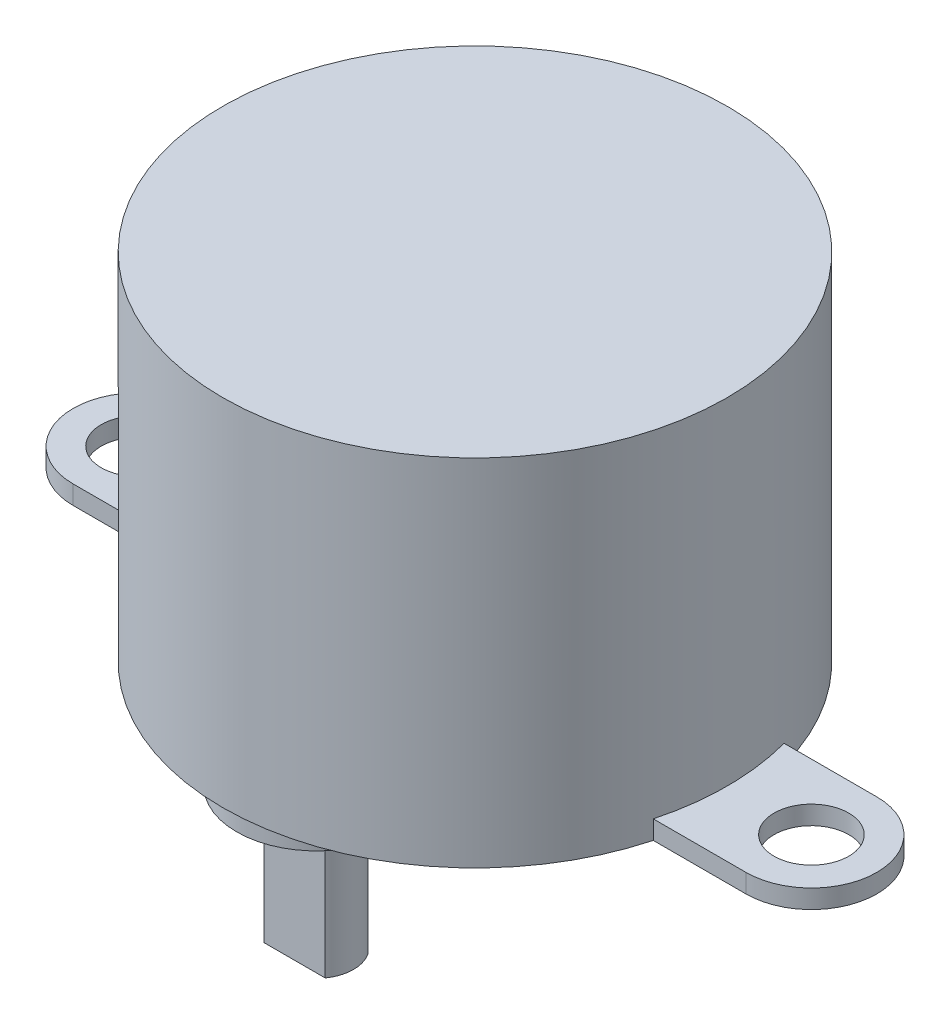
ISO-10303-21;
HEADER;
FILE_DESCRIPTION(('STEP AP214'),'2;1');
FILE_NAME('part.step','',(''),(''),'','','');
FILE_SCHEMA(('AUTOMOTIVE_DESIGN { 1 0 10303 214 1 1 1 1 }'));
ENDSEC;
DATA;
#1=APPLICATION_CONTEXT('core data for automotive mechanical design processes');
#2=APPLICATION_PROTOCOL_DEFINITION('international standard','automotive_design',2000,#1);
#3=PRODUCT_CONTEXT('',#1,'mechanical');
#4=PRODUCT('Part','Part','',(#3));
#5=PRODUCT_RELATED_PRODUCT_CATEGORY('part','',(#4));
#6=PRODUCT_DEFINITION_FORMATION('','',#4);
#7=PRODUCT_DEFINITION_CONTEXT('part definition',#1,'design');
#8=PRODUCT_DEFINITION('design','',#6,#7);
#9=PRODUCT_DEFINITION_SHAPE('','',#8);
#10=(LENGTH_UNIT() NAMED_UNIT(*) SI_UNIT(.MILLI.,.METRE.));
#11=(NAMED_UNIT(*) PLANE_ANGLE_UNIT() SI_UNIT($,.RADIAN.));
#12=(NAMED_UNIT(*) SI_UNIT($,.STERADIAN.) SOLID_ANGLE_UNIT());
#13=UNCERTAINTY_MEASURE_WITH_UNIT(LENGTH_MEASURE(1.E-05),#10,'distance_accuracy_value','');
#14=(GEOMETRIC_REPRESENTATION_CONTEXT(3) GLOBAL_UNCERTAINTY_ASSIGNED_CONTEXT((#13)) GLOBAL_UNIT_ASSIGNED_CONTEXT((#10,
#11,#12)) REPRESENTATION_CONTEXT('',''));
#15=CARTESIAN_POINT('',(0.,0.,0.));
#16=DIRECTION('',(0.,0.,1.));
#17=DIRECTION('',(1.,0.,0.));
#18=AXIS2_PLACEMENT_3D('',#15,#16,#17);
#19=CARTESIAN_POINT('',(0.,-3.,8.5));
#20=DIRECTION('',(0.,-1.,0.));
#21=DIRECTION('',(0.,0.,-1.));
#22=AXIS2_PLACEMENT_3D('',#19,#20,#21);
#23=PLANE('',#22);
#24=DIRECTION('',(-1.,0.,0.));
#25=VECTOR('',#24,1.);
#26=CARTESIAN_POINT('',(-1.63630681719536,-3.,9.65));
#27=LINE('',#26,#25);
#28=CARTESIAN_POINT('',(1.63630681719536,-3.,9.65));
#29=VERTEX_POINT('',#28);
#30=CARTESIAN_POINT('',(-1.63630681719536,-3.,9.65));
#31=VERTEX_POINT('',#30);
#32=EDGE_CURVE('E151',#29,#31,#27,.T.);
#33=ORIENTED_EDGE('',*,*,#32,.F.);
#34=CARTESIAN_POINT('',(0.,-3.,8.5));
#35=DIRECTION('',(0.,-1.,0.));
#36=DIRECTION('',(0.,0.,-1.));
#37=AXIS2_PLACEMENT_3D('',#34,#35,#36);
#38=CIRCLE('',#37,2.);
#39=EDGE_CURVE('E62',#29,#31,#38,.T.);
#40=ORIENTED_EDGE('',*,*,#39,.T.);
#41=EDGE_LOOP('',(#33,#40));
#42=FACE_BOUND('',#41,.T.);
#43=ADVANCED_FACE('F39',(#42),#23,.T.);
#44=CARTESIAN_POINT('',(0.,19.,0.));
#45=DIRECTION('',(0.,-1.,0.));
#46=DIRECTION('',(0.,0.,-1.));
#47=AXIS2_PLACEMENT_3D('',#44,#45,#46);
#48=CYLINDRICAL_SURFACE('',#47,13.5);
#49=CARTESIAN_POINT('',(0.,19.,0.));
#50=DIRECTION('',(0.,1.,0.));
#51=DIRECTION('',(0.,0.,1.));
#52=AXIS2_PLACEMENT_3D('',#49,#50,#51);
#53=CIRCLE('',#52,13.5);
#54=CARTESIAN_POINT('',(0.,19.,13.5));
#55=VERTEX_POINT('',#54);
#56=EDGE_CURVE('E269',#55,#55,#53,.T.);
#57=ORIENTED_EDGE('',*,*,#56,.F.);
#58=EDGE_LOOP('',(#57));
#59=FACE_BOUND('',#58,.T.);
#60=DIRECTION('',(0.,-1.,0.));
#61=VECTOR('',#60,1.);
#62=CARTESIAN_POINT('',(-13.0384048104053,1.,3.5));
#63=LINE('',#62,#61);
#64=CARTESIAN_POINT('',(-13.0384048104053,1.,3.5));
#65=VERTEX_POINT('',#64);
#66=CARTESIAN_POINT('',(-13.0384048104053,0.,3.5));
#67=VERTEX_POINT('',#66);
#68=EDGE_CURVE('E209',#65,#67,#63,.T.);
#69=ORIENTED_EDGE('',*,*,#68,.T.);
#70=CARTESIAN_POINT('',(0.,0.,0.));
#71=DIRECTION('',(0.,1.,0.));
#72=DIRECTION('',(0.,0.,1.));
#73=AXIS2_PLACEMENT_3D('',#70,#71,#72);
#74=CIRCLE('',#73,13.5);
#75=CARTESIAN_POINT('',(13.0384048104053,0.,3.5));
#76=VERTEX_POINT('',#75);
#77=EDGE_CURVE('E258',#67,#76,#74,.T.);
#78=ORIENTED_EDGE('',*,*,#77,.T.);
#79=DIRECTION('',(0.,-1.,0.));
#80=VECTOR('',#79,1.);
#81=CARTESIAN_POINT('',(13.0384048104053,1.,3.5));
#82=LINE('',#81,#80);
#83=CARTESIAN_POINT('',(13.0384048104053,1.,3.5));
#84=VERTEX_POINT('',#83);
#85=EDGE_CURVE('E263',#84,#76,#82,.T.);
#86=ORIENTED_EDGE('',*,*,#85,.F.);
#87=CARTESIAN_POINT('',(0.,1.,0.));
#88=DIRECTION('',(0.,1.,0.));
#89=DIRECTION('',(0.,0.,-1.));
#90=AXIS2_PLACEMENT_3D('',#87,#88,#89);
#91=CIRCLE('',#90,13.5);
#92=CARTESIAN_POINT('',(13.0384048104053,1.,-3.5));
#93=VERTEX_POINT('',#92);
#94=EDGE_CURVE('E237',#84,#93,#91,.T.);
#95=ORIENTED_EDGE('',*,*,#94,.T.);
#96=DIRECTION('',(0.,-1.,0.));
#97=VECTOR('',#96,1.);
#98=CARTESIAN_POINT('',(13.0384048104053,1.,-3.5));
#99=LINE('',#98,#97);
#100=CARTESIAN_POINT('',(13.0384048104053,0.,-3.5));
#101=VERTEX_POINT('',#100);
#102=EDGE_CURVE('E259',#93,#101,#99,.T.);
#103=ORIENTED_EDGE('',*,*,#102,.T.);
#104=CARTESIAN_POINT('',(-13.0384048104053,0.,-3.5));
#105=VERTEX_POINT('',#104);
#106=EDGE_CURVE('E272',#101,#105,#74,.T.);
#107=ORIENTED_EDGE('',*,*,#106,.T.);
#108=DIRECTION('',(0.,-1.,0.));
#109=VECTOR('',#108,1.);
#110=CARTESIAN_POINT('',(-13.0384048104053,1.,-3.5));
#111=LINE('',#110,#109);
#112=CARTESIAN_POINT('',(-13.0384048104053,0.999999999999997,-3.5));
#113=VERTEX_POINT('',#112);
#114=EDGE_CURVE('E213',#113,#105,#111,.T.);
#115=ORIENTED_EDGE('',*,*,#114,.F.);
#116=CARTESIAN_POINT('',(0.,1.,0.));
#117=DIRECTION('',(0.,-1.,0.));
#118=DIRECTION('',(0.,0.,-1.));
#119=AXIS2_PLACEMENT_3D('',#116,#117,#118);
#120=CIRCLE('',#119,13.5);
#121=EDGE_CURVE('E186',#65,#113,#120,.T.);
#122=ORIENTED_EDGE('',*,*,#121,.F.);
#123=EDGE_LOOP('',(#69,#78,#86,#95,#103,#107,#115,#122));
#124=FACE_BOUND('',#123,.T.);
#125=ADVANCED_FACE('F41',(#59,#124),#48,.T.);
#126=CARTESIAN_POINT('',(0.,19.,0.));
#127=DIRECTION('',(0.,1.,0.));
#128=DIRECTION('',(0.,0.,1.));
#129=AXIS2_PLACEMENT_3D('',#126,#127,#128);
#130=PLANE('',#129);
#131=ORIENTED_EDGE('',*,*,#56,.T.);
#132=EDGE_LOOP('',(#131));
#133=FACE_BOUND('',#132,.T.);
#134=ADVANCED_FACE('F311',(#133),#130,.T.);
#135=CARTESIAN_POINT('',(0.,0.,0.));
#136=DIRECTION('',(0.,1.,0.));
#137=DIRECTION('',(0.,0.,1.));
#138=AXIS2_PLACEMENT_3D('',#135,#136,#137);
#139=PLANE('',#138);
#140=CARTESIAN_POINT('',(0.,0.,8.5));
#141=DIRECTION('',(0.,1.,0.));
#142=DIRECTION('',(0.,0.,1.));
#143=AXIS2_PLACEMENT_3D('',#140,#141,#142);
#144=CIRCLE('',#143,4.25);
#145=CARTESIAN_POINT('',(0.,0.,12.75));
#146=VERTEX_POINT('',#145);
#147=EDGE_CURVE('E43',#146,#146,#144,.F.);
#148=ORIENTED_EDGE('',*,*,#147,.F.);
#149=EDGE_LOOP('',(#148));
#150=FACE_BOUND('',#149,.T.);
#151=ORIENTED_EDGE('',*,*,#106,.F.);
#152=DIRECTION('',(1.,0.,0.));
#153=VECTOR('',#152,1.);
#154=CARTESIAN_POINT('',(18.,0.,-3.5));
#155=LINE('',#154,#153);
#156=CARTESIAN_POINT('',(18.,0.,-3.5));
#157=VERTEX_POINT('',#156);
#158=EDGE_CURVE('E233',#101,#157,#155,.T.);
#159=ORIENTED_EDGE('',*,*,#158,.T.);
#160=CARTESIAN_POINT('',(18.,0.,0.));
#161=DIRECTION('',(0.,-1.,0.));
#162=DIRECTION('',(0.,0.,-1.));
#163=AXIS2_PLACEMENT_3D('',#160,#161,#162);
#164=CIRCLE('',#163,3.5);
#165=CARTESIAN_POINT('',(18.,0.,3.5));
#166=VERTEX_POINT('',#165);
#167=EDGE_CURVE('E224',#157,#166,#164,.T.);
#168=ORIENTED_EDGE('',*,*,#167,.T.);
#169=DIRECTION('',(-1.,0.,0.));
#170=VECTOR('',#169,1.);
#171=CARTESIAN_POINT('',(18.,0.,3.5));
#172=LINE('',#171,#170);
#173=EDGE_CURVE('E248',#166,#76,#172,.T.);
#174=ORIENTED_EDGE('',*,*,#173,.T.);
#175=ORIENTED_EDGE('',*,*,#77,.F.);
#176=DIRECTION('',(1.,0.,0.));
#177=VECTOR('',#176,1.);
#178=CARTESIAN_POINT('',(-18.,0.,3.5));
#179=LINE('',#178,#177);
#180=CARTESIAN_POINT('',(-18.,0.,3.5));
#181=VERTEX_POINT('',#180);
#182=EDGE_CURVE('E183',#181,#67,#179,.T.);
#183=ORIENTED_EDGE('',*,*,#182,.F.);
#184=CARTESIAN_POINT('',(-18.,0.,0.));
#185=DIRECTION('',(0.,1.,0.));
#186=DIRECTION('',(0.,0.,-1.));
#187=AXIS2_PLACEMENT_3D('',#184,#185,#186);
#188=CIRCLE('',#187,3.5);
#189=CARTESIAN_POINT('',(-18.,0.,-3.5));
#190=VERTEX_POINT('',#189);
#191=EDGE_CURVE('E174',#190,#181,#188,.T.);
#192=ORIENTED_EDGE('',*,*,#191,.F.);
#193=DIRECTION('',(-1.,0.,0.));
#194=VECTOR('',#193,1.);
#195=CARTESIAN_POINT('',(-18.,0.,-3.5));
#196=LINE('',#195,#194);
#197=EDGE_CURVE('E198',#105,#190,#196,.T.);
#198=ORIENTED_EDGE('',*,*,#197,.F.);
#199=EDGE_LOOP('',(#151,#159,#168,#174,#175,#183,#192,#198));
#200=FACE_BOUND('',#199,.T.);
#201=CARTESIAN_POINT('',(18.,0.,0.));
#202=DIRECTION('',(0.,-1.,0.));
#203=DIRECTION('',(0.,0.,-1.));
#204=AXIS2_PLACEMENT_3D('',#201,#202,#203);
#205=CIRCLE('',#204,2.);
#206=CARTESIAN_POINT('',(18.,0.,-2.00000000000001));
#207=VERTEX_POINT('',#206);
#208=EDGE_CURVE('E208',#207,#207,#205,.T.);
#209=ORIENTED_EDGE('',*,*,#208,.F.);
#210=EDGE_LOOP('',(#209));
#211=FACE_BOUND('',#210,.T.);
#212=CARTESIAN_POINT('',(-18.,0.,0.));
#213=DIRECTION('',(0.,1.,0.));
#214=DIRECTION('',(0.,0.,-1.));
#215=AXIS2_PLACEMENT_3D('',#212,#213,#214);
#216=CIRCLE('',#215,2.);
#217=CARTESIAN_POINT('',(-18.,0.,-2.00000000000001));
#218=VERTEX_POINT('',#217);
#219=EDGE_CURVE('E169',#218,#218,#216,.T.);
#220=ORIENTED_EDGE('',*,*,#219,.T.);
#221=EDGE_LOOP('',(#220));
#222=FACE_BOUND('',#221,.T.);
#223=ADVANCED_FACE('F283',(#150,#200,#211,#222),#139,.F.);
#224=CARTESIAN_POINT('',(18.,1.,0.));
#225=DIRECTION('',(0.,-1.,0.));
#226=DIRECTION('',(0.,0.,-1.));
#227=AXIS2_PLACEMENT_3D('',#224,#225,#226);
#228=CYLINDRICAL_SURFACE('',#227,3.5);
#229=ORIENTED_EDGE('',*,*,#167,.F.);
#230=DIRECTION('',(0.,-1.,0.));
#231=VECTOR('',#230,1.);
#232=CARTESIAN_POINT('',(18.,1.,-3.5));
#233=LINE('',#232,#231);
#234=CARTESIAN_POINT('',(18.,1.,-3.5));
#235=VERTEX_POINT('',#234);
#236=EDGE_CURVE('E255',#235,#157,#233,.T.);
#237=ORIENTED_EDGE('',*,*,#236,.F.);
#238=CARTESIAN_POINT('',(18.,1.,0.));
#239=DIRECTION('',(0.,-1.,0.));
#240=DIRECTION('',(0.,0.,-1.));
#241=AXIS2_PLACEMENT_3D('',#238,#239,#240);
#242=CIRCLE('',#241,3.5);
#243=CARTESIAN_POINT('',(18.,1.,3.5));
#244=VERTEX_POINT('',#243);
#245=EDGE_CURVE('E228',#235,#244,#242,.T.);
#246=ORIENTED_EDGE('',*,*,#245,.T.);
#247=DIRECTION('',(0.,-1.,0.));
#248=VECTOR('',#247,1.);
#249=CARTESIAN_POINT('',(18.,1.,3.5));
#250=LINE('',#249,#248);
#251=EDGE_CURVE('E244',#244,#166,#250,.T.);
#252=ORIENTED_EDGE('',*,*,#251,.T.);
#253=EDGE_LOOP('',(#229,#237,#246,#252));
#254=FACE_BOUND('',#253,.T.);
#255=ADVANCED_FACE('F288',(#254),#228,.T.);
#256=CARTESIAN_POINT('',(18.,1.,-3.5));
#257=DIRECTION('',(0.,0.,-1.));
#258=DIRECTION('',(-1.,0.,0.));
#259=AXIS2_PLACEMENT_3D('',#256,#257,#258);
#260=PLANE('',#259);
#261=ORIENTED_EDGE('',*,*,#158,.F.);
#262=ORIENTED_EDGE('',*,*,#102,.F.);
#263=DIRECTION('',(1.,0.,0.));
#264=VECTOR('',#263,1.);
#265=CARTESIAN_POINT('',(18.,1.,-3.5));
#266=LINE('',#265,#264);
#267=EDGE_CURVE('E240',#93,#235,#266,.T.);
#268=ORIENTED_EDGE('',*,*,#267,.T.);
#269=ORIENTED_EDGE('',*,*,#236,.T.);
#270=EDGE_LOOP('',(#261,#262,#268,#269));
#271=FACE_BOUND('',#270,.T.);
#272=ADVANCED_FACE('F295',(#271),#260,.T.);
#273=CARTESIAN_POINT('',(18.,1.,3.5));
#274=DIRECTION('',(0.,0.,1.));
#275=DIRECTION('',(1.,0.,0.));
#276=AXIS2_PLACEMENT_3D('',#273,#274,#275);
#277=PLANE('',#276);
#278=ORIENTED_EDGE('',*,*,#173,.F.);
#279=ORIENTED_EDGE('',*,*,#251,.F.);
#280=DIRECTION('',(-1.,0.,0.));
#281=VECTOR('',#280,1.);
#282=CARTESIAN_POINT('',(18.,1.,3.5));
#283=LINE('',#282,#281);
#284=EDGE_CURVE('E232',#244,#84,#283,.T.);
#285=ORIENTED_EDGE('',*,*,#284,.T.);
#286=ORIENTED_EDGE('',*,*,#85,.T.);
#287=EDGE_LOOP('',(#278,#279,#285,#286));
#288=FACE_BOUND('',#287,.T.);
#289=ADVANCED_FACE('F281',(#288),#277,.T.);
#290=CARTESIAN_POINT('',(18.,1.,0.));
#291=DIRECTION('',(0.,-1.,0.));
#292=DIRECTION('',(0.,0.,-1.));
#293=AXIS2_PLACEMENT_3D('',#290,#291,#292);
#294=PLANE('',#293);
#295=CARTESIAN_POINT('',(18.,1.,0.));
#296=DIRECTION('',(0.,-1.,0.));
#297=DIRECTION('',(0.,0.,-1.));
#298=AXIS2_PLACEMENT_3D('',#295,#296,#297);
#299=CIRCLE('',#298,2.);
#300=CARTESIAN_POINT('',(18.,1.,-2.00000000000001));
#301=VERTEX_POINT('',#300);
#302=EDGE_CURVE('E220',#301,#301,#299,.T.);
#303=ORIENTED_EDGE('',*,*,#302,.T.);
#304=EDGE_LOOP('',(#303));
#305=FACE_BOUND('',#304,.T.);
#306=ORIENTED_EDGE('',*,*,#245,.F.);
#307=ORIENTED_EDGE('',*,*,#267,.F.);
#308=ORIENTED_EDGE('',*,*,#94,.F.);
#309=ORIENTED_EDGE('',*,*,#284,.F.);
#310=EDGE_LOOP('',(#306,#307,#308,#309));
#311=FACE_BOUND('',#310,.T.);
#312=ADVANCED_FACE('F291',(#305,#311),#294,.F.);
#313=CARTESIAN_POINT('',(18.,1.,0.));
#314=DIRECTION('',(0.,-1.,0.));
#315=DIRECTION('',(0.,0.,-1.));
#316=AXIS2_PLACEMENT_3D('',#313,#314,#315);
#317=CYLINDRICAL_SURFACE('',#316,2.);
#318=ORIENTED_EDGE('',*,*,#302,.F.);
#319=EDGE_LOOP('',(#318));
#320=FACE_BOUND('',#319,.T.);
#321=ORIENTED_EDGE('',*,*,#208,.T.);
#322=EDGE_LOOP('',(#321));
#323=FACE_BOUND('',#322,.T.);
#324=ADVANCED_FACE('F341',(#320,#323),#317,.F.);
#325=CARTESIAN_POINT('',(-18.,1.,0.));
#326=DIRECTION('',(0.,-1.,0.));
#327=DIRECTION('',(0.,0.,-1.));
#328=AXIS2_PLACEMENT_3D('',#325,#326,#327);
#329=PLANE('',#328);
#330=CARTESIAN_POINT('',(-18.,1.,0.));
#331=DIRECTION('',(0.,1.,0.));
#332=DIRECTION('',(0.,0.,-1.));
#333=AXIS2_PLACEMENT_3D('',#330,#331,#332);
#334=CIRCLE('',#333,3.5);
#335=CARTESIAN_POINT('',(-18.,1.,-3.5));
#336=VERTEX_POINT('',#335);
#337=CARTESIAN_POINT('',(-18.,1.,3.5));
#338=VERTEX_POINT('',#337);
#339=EDGE_CURVE('E178',#336,#338,#334,.T.);
#340=ORIENTED_EDGE('',*,*,#339,.T.);
#341=DIRECTION('',(1.,0.,0.));
#342=VECTOR('',#341,1.);
#343=CARTESIAN_POINT('',(-18.,1.,3.5));
#344=LINE('',#343,#342);
#345=EDGE_CURVE('E190',#338,#65,#344,.T.);
#346=ORIENTED_EDGE('',*,*,#345,.T.);
#347=ORIENTED_EDGE('',*,*,#121,.T.);
#348=DIRECTION('',(-1.,0.,0.));
#349=VECTOR('',#348,1.);
#350=CARTESIAN_POINT('',(-18.,1.,-3.5));
#351=LINE('',#350,#349);
#352=EDGE_CURVE('E182',#113,#336,#351,.T.);
#353=ORIENTED_EDGE('',*,*,#352,.T.);
#354=EDGE_LOOP('',(#340,#346,#347,#353));
#355=FACE_BOUND('',#354,.T.);
#356=CARTESIAN_POINT('',(-18.,1.,0.));
#357=DIRECTION('',(0.,1.,0.));
#358=DIRECTION('',(0.,0.,-1.));
#359=AXIS2_PLACEMENT_3D('',#356,#357,#358);
#360=CIRCLE('',#359,2.);
#361=CARTESIAN_POINT('',(-18.,1.,-2.00000000000001));
#362=VERTEX_POINT('',#361);
#363=EDGE_CURVE('E170',#362,#362,#360,.T.);
#364=ORIENTED_EDGE('',*,*,#363,.F.);
#365=EDGE_LOOP('',(#364));
#366=FACE_BOUND('',#365,.T.);
#367=ADVANCED_FACE('F337',(#355,#366),#329,.F.);
#368=CARTESIAN_POINT('',(-18.,1.,0.));
#369=DIRECTION('',(0.,-1.,0.));
#370=DIRECTION('',(0.,0.,-1.));
#371=AXIS2_PLACEMENT_3D('',#368,#369,#370);
#372=CYLINDRICAL_SURFACE('',#371,3.5);
#373=ORIENTED_EDGE('',*,*,#191,.T.);
#374=DIRECTION('',(0.,-1.,0.));
#375=VECTOR('',#374,1.);
#376=CARTESIAN_POINT('',(-18.,1.,3.5));
#377=LINE('',#376,#375);
#378=EDGE_CURVE('E204',#338,#181,#377,.T.);
#379=ORIENTED_EDGE('',*,*,#378,.F.);
#380=ORIENTED_EDGE('',*,*,#339,.F.);
#381=DIRECTION('',(0.,-1.,0.));
#382=VECTOR('',#381,1.);
#383=CARTESIAN_POINT('',(-18.,1.,-3.5));
#384=LINE('',#383,#382);
#385=EDGE_CURVE('E194',#336,#190,#384,.T.);
#386=ORIENTED_EDGE('',*,*,#385,.T.);
#387=EDGE_LOOP('',(#373,#379,#380,#386));
#388=FACE_BOUND('',#387,.T.);
#389=ADVANCED_FACE('F340',(#388),#372,.T.);
#390=CARTESIAN_POINT('',(-18.,1.,3.5));
#391=DIRECTION('',(0.,0.,-1.));
#392=DIRECTION('',(-1.,0.,0.));
#393=AXIS2_PLACEMENT_3D('',#390,#391,#392);
#394=PLANE('',#393);
#395=ORIENTED_EDGE('',*,*,#182,.T.);
#396=ORIENTED_EDGE('',*,*,#68,.F.);
#397=ORIENTED_EDGE('',*,*,#345,.F.);
#398=ORIENTED_EDGE('',*,*,#378,.T.);
#399=EDGE_LOOP('',(#395,#396,#397,#398));
#400=FACE_BOUND('',#399,.T.);
#401=ADVANCED_FACE('F343',(#400),#394,.F.);
#402=CARTESIAN_POINT('',(-18.,1.,-3.5));
#403=DIRECTION('',(0.,0.,1.));
#404=DIRECTION('',(1.,0.,0.));
#405=AXIS2_PLACEMENT_3D('',#402,#403,#404);
#406=PLANE('',#405);
#407=ORIENTED_EDGE('',*,*,#197,.T.);
#408=ORIENTED_EDGE('',*,*,#385,.F.);
#409=ORIENTED_EDGE('',*,*,#352,.F.);
#410=ORIENTED_EDGE('',*,*,#114,.T.);
#411=EDGE_LOOP('',(#407,#408,#409,#410));
#412=FACE_BOUND('',#411,.T.);
#413=ADVANCED_FACE('F335',(#412),#406,.F.);
#414=CARTESIAN_POINT('',(-18.,1.,0.));
#415=DIRECTION('',(0.,-1.,0.));
#416=DIRECTION('',(0.,0.,-1.));
#417=AXIS2_PLACEMENT_3D('',#414,#415,#416);
#418=CYLINDRICAL_SURFACE('',#417,2.);
#419=ORIENTED_EDGE('',*,*,#363,.T.);
#420=EDGE_LOOP('',(#419));
#421=FACE_BOUND('',#420,.T.);
#422=ORIENTED_EDGE('',*,*,#219,.F.);
#423=EDGE_LOOP('',(#422));
#424=FACE_BOUND('',#423,.T.);
#425=ADVANCED_FACE('F331',(#421,#424),#418,.F.);
#426=CARTESIAN_POINT('',(0.,-1.5,8.5));
#427=DIRECTION('',(0.,1.,0.));
#428=DIRECTION('',(0.,0.,1.));
#429=AXIS2_PLACEMENT_3D('',#426,#427,#428);
#430=CYLINDRICAL_SURFACE('',#429,4.25);
#431=CARTESIAN_POINT('',(0.,-1.5,8.5));
#432=DIRECTION('',(0.,-1.,0.));
#433=DIRECTION('',(0.,0.,-1.));
#434=AXIS2_PLACEMENT_3D('',#431,#432,#433);
#435=CIRCLE('',#434,4.25);
#436=CARTESIAN_POINT('',(0.,-1.5,4.25));
#437=VERTEX_POINT('',#436);
#438=EDGE_CURVE('E165',#437,#437,#435,.T.);
#439=ORIENTED_EDGE('',*,*,#438,.F.);
#440=EDGE_LOOP('',(#439));
#441=FACE_BOUND('',#440,.T.);
#442=ORIENTED_EDGE('',*,*,#147,.T.);
#443=EDGE_LOOP('',(#442));
#444=FACE_BOUND('',#443,.T.);
#445=ADVANCED_FACE('F325',(#441,#444),#430,.T.);
#446=CARTESIAN_POINT('',(0.,-1.5,8.5));
#447=DIRECTION('',(0.,-1.,0.));
#448=DIRECTION('',(0.,0.,-1.));
#449=AXIS2_PLACEMENT_3D('',#446,#447,#448);
#450=PLANE('',#449);
#451=CARTESIAN_POINT('',(0.,-1.5,8.5));
#452=DIRECTION('',(0.,-1.,0.));
#453=DIRECTION('',(0.,0.,-1.));
#454=AXIS2_PLACEMENT_3D('',#451,#452,#453);
#455=CIRCLE('',#454,2.);
#456=CARTESIAN_POINT('',(0.,-1.5,6.5));
#457=VERTEX_POINT('',#456);
#458=EDGE_CURVE('E11',#457,#457,#455,.T.);
#459=ORIENTED_EDGE('',*,*,#458,.F.);
#460=EDGE_LOOP('',(#459));
#461=FACE_BOUND('',#460,.T.);
#462=ORIENTED_EDGE('',*,*,#438,.T.);
#463=EDGE_LOOP('',(#462));
#464=FACE_BOUND('',#463,.T.);
#465=ADVANCED_FACE('F321',(#461,#464),#450,.T.);
#466=CARTESIAN_POINT('',(0.,-3.,8.5));
#467=DIRECTION('',(0.,1.,0.));
#468=DIRECTION('',(0.,0.,1.));
#469=AXIS2_PLACEMENT_3D('',#466,#467,#468);
#470=CYLINDRICAL_SURFACE('',#469,2.);
#471=ORIENTED_EDGE('',*,*,#39,.F.);
#472=DIRECTION('',(0.,1.,0.));
#473=VECTOR('',#472,1.);
#474=CARTESIAN_POINT('',(1.63630681719536,-9.,9.65));
#475=LINE('',#474,#473);
#476=CARTESIAN_POINT('',(1.63630681719536,-9.,9.65));
#477=VERTEX_POINT('',#476);
#478=EDGE_CURVE('E161',#477,#29,#475,.T.);
#479=ORIENTED_EDGE('',*,*,#478,.F.);
#480=CARTESIAN_POINT('',(0.,-9.,8.5));
#481=DIRECTION('',(0.,-1.,0.));
#482=DIRECTION('',(0.,0.,-1.));
#483=AXIS2_PLACEMENT_3D('',#480,#481,#482);
#484=CIRCLE('',#483,2.);
#485=CARTESIAN_POINT('',(1.63630681719536,-9.,7.35));
#486=VERTEX_POINT('',#485);
#487=EDGE_CURVE('E140',#486,#477,#484,.T.);
#488=ORIENTED_EDGE('',*,*,#487,.F.);
#489=DIRECTION('',(0.,1.,0.));
#490=VECTOR('',#489,1.);
#491=CARTESIAN_POINT('',(1.63630681719536,-9.,7.35));
#492=LINE('',#491,#490);
#493=CARTESIAN_POINT('',(1.63630681719536,-3.,7.35));
#494=VERTEX_POINT('',#493);
#495=EDGE_CURVE('E136',#486,#494,#492,.T.);
#496=ORIENTED_EDGE('',*,*,#495,.T.);
#497=CARTESIAN_POINT('',(-1.63630681719536,-3.,7.35));
#498=VERTEX_POINT('',#497);
#499=EDGE_CURVE('E155',#498,#494,#38,.T.);
#500=ORIENTED_EDGE('',*,*,#499,.F.);
#501=DIRECTION('',(0.,1.,0.));
#502=VECTOR('',#501,1.);
#503=CARTESIAN_POINT('',(-1.63630681719536,-9.,7.35));
#504=LINE('',#503,#502);
#505=CARTESIAN_POINT('',(-1.63630681719536,-9.,7.35));
#506=VERTEX_POINT('',#505);
#507=EDGE_CURVE('E134',#506,#498,#504,.T.);
#508=ORIENTED_EDGE('',*,*,#507,.F.);
#509=CARTESIAN_POINT('',(0.,-9.,8.5));
#510=DIRECTION('',(0.,-1.,0.));
#511=DIRECTION('',(0.,0.,-1.));
#512=AXIS2_PLACEMENT_3D('',#509,#510,#511);
#513=CIRCLE('',#512,2.);
#514=CARTESIAN_POINT('',(-1.63630681719536,-9.,9.65));
#515=VERTEX_POINT('',#514);
#516=EDGE_CURVE('E141',#515,#506,#513,.T.);
#517=ORIENTED_EDGE('',*,*,#516,.F.);
#518=DIRECTION('',(0.,1.,0.));
#519=VECTOR('',#518,1.);
#520=CARTESIAN_POINT('',(-1.63630681719536,-9.,9.65));
#521=LINE('',#520,#519);
#522=EDGE_CURVE('E476',#515,#31,#521,.T.);
#523=ORIENTED_EDGE('',*,*,#522,.T.);
#524=EDGE_LOOP('',(#471,#479,#488,#496,#500,#508,#517,#523));
#525=FACE_BOUND('',#524,.T.);
#526=ORIENTED_EDGE('',*,*,#458,.T.);
#527=EDGE_LOOP('',(#526));
#528=FACE_BOUND('',#527,.T.);
#529=ADVANCED_FACE('F153',(#525,#528),#470,.T.);
#530=DIRECTION('',(1.,0.,0.));
#531=VECTOR('',#530,1.);
#532=CARTESIAN_POINT('',(-1.63630681719536,-3.,7.35));
#533=LINE('',#532,#531);
#534=EDGE_CURVE('E55',#498,#494,#533,.T.);
#535=ORIENTED_EDGE('',*,*,#534,.F.);
#536=ORIENTED_EDGE('',*,*,#499,.T.);
#537=EDGE_LOOP('',(#535,#536));
#538=FACE_BOUND('',#537,.T.);
#539=ADVANCED_FACE('F307',(#538),#23,.T.);
#540=CARTESIAN_POINT('',(-1.63630681719536,-9.,7.35));
#541=DIRECTION('',(0.,0.,1.));
#542=DIRECTION('',(1.,0.,0.));
#543=AXIS2_PLACEMENT_3D('',#540,#541,#542);
#544=PLANE('',#543);
#545=ORIENTED_EDGE('',*,*,#534,.T.);
#546=ORIENTED_EDGE('',*,*,#495,.F.);
#547=DIRECTION('',(1.,0.,0.));
#548=VECTOR('',#547,1.);
#549=CARTESIAN_POINT('',(-1.63630681719536,-9.,7.35));
#550=LINE('',#549,#548);
#551=EDGE_CURVE('E130',#506,#486,#550,.T.);
#552=ORIENTED_EDGE('',*,*,#551,.F.);
#553=ORIENTED_EDGE('',*,*,#507,.T.);
#554=EDGE_LOOP('',(#545,#546,#552,#553));
#555=FACE_BOUND('',#554,.T.);
#556=ADVANCED_FACE('F132',(#555),#544,.F.);
#557=CARTESIAN_POINT('',(-1.63630681719536,-9.,9.65));
#558=DIRECTION('',(0.,0.,-1.));
#559=DIRECTION('',(-1.,0.,0.));
#560=AXIS2_PLACEMENT_3D('',#557,#558,#559);
#561=PLANE('',#560);
#562=ORIENTED_EDGE('',*,*,#32,.T.);
#563=ORIENTED_EDGE('',*,*,#522,.F.);
#564=DIRECTION('',(-1.,0.,0.));
#565=VECTOR('',#564,1.);
#566=CARTESIAN_POINT('',(-1.63630681719536,-9.,9.65));
#567=LINE('',#566,#565);
#568=EDGE_CURVE('E146',#477,#515,#567,.T.);
#569=ORIENTED_EDGE('',*,*,#568,.F.);
#570=ORIENTED_EDGE('',*,*,#478,.T.);
#571=EDGE_LOOP('',(#562,#563,#569,#570));
#572=FACE_BOUND('',#571,.T.);
#573=ADVANCED_FACE('F320',(#572),#561,.F.);
#574=CARTESIAN_POINT('',(0.,-9.,8.5));
#575=DIRECTION('',(0.,-1.,0.));
#576=DIRECTION('',(0.,0.,-1.));
#577=AXIS2_PLACEMENT_3D('',#574,#575,#576);
#578=PLANE('',#577);
#579=ORIENTED_EDGE('',*,*,#516,.T.);
#580=ORIENTED_EDGE('',*,*,#551,.T.);
#581=ORIENTED_EDGE('',*,*,#487,.T.);
#582=ORIENTED_EDGE('',*,*,#568,.T.);
#583=EDGE_LOOP('',(#579,#580,#581,#582));
#584=FACE_BOUND('',#583,.T.);
#585=ADVANCED_FACE('F144',(#584),#578,.T.);
#586=CLOSED_SHELL('',(#43,#125,#134,#223,#255,#272,#289,#312,#324,#367,#389,#401,#413,#425,#445,
#465,#529,#539,#556,#573,#585));
#587=MANIFOLD_SOLID_BREP('B2',#586);
#588=ADVANCED_BREP_SHAPE_REPRESENTATION('',(#18,#587),#14);
#589=SHAPE_DEFINITION_REPRESENTATION(#9,#588);
ENDSEC;
END-ISO-10303-21;
